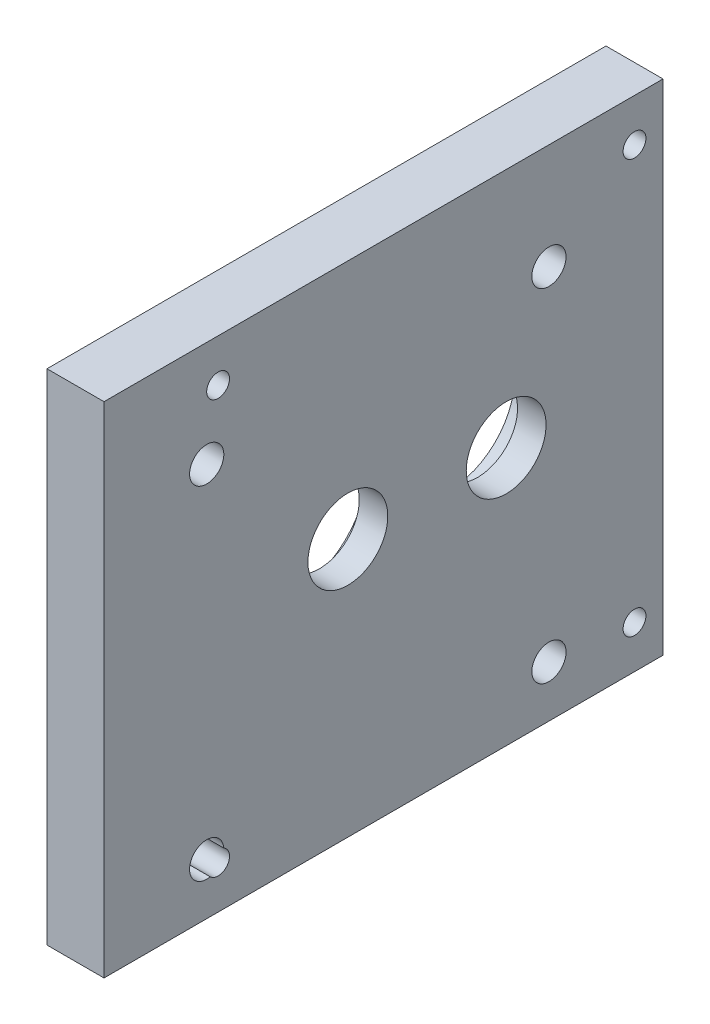
ISO-10303-21;
HEADER;
FILE_DESCRIPTION(('STEP AP214'),'2;1');
FILE_NAME('part.step','',(''),(''),'','','');
FILE_SCHEMA(('AUTOMOTIVE_DESIGN { 1 0 10303 214 1 1 1 1 }'));
ENDSEC;
DATA;
#1=APPLICATION_CONTEXT('core data for automotive mechanical design processes');
#2=APPLICATION_PROTOCOL_DEFINITION('international standard','automotive_design',2000,#1);
#3=PRODUCT_CONTEXT('',#1,'mechanical');
#4=PRODUCT('Part','Part','',(#3));
#5=PRODUCT_RELATED_PRODUCT_CATEGORY('part','',(#4));
#6=PRODUCT_DEFINITION_FORMATION('','',#4);
#7=PRODUCT_DEFINITION_CONTEXT('part definition',#1,'design');
#8=PRODUCT_DEFINITION('design','',#6,#7);
#9=PRODUCT_DEFINITION_SHAPE('','',#8);
#10=(LENGTH_UNIT() NAMED_UNIT(*) SI_UNIT(.MILLI.,.METRE.));
#11=(NAMED_UNIT(*) PLANE_ANGLE_UNIT() SI_UNIT($,.RADIAN.));
#12=(NAMED_UNIT(*) SI_UNIT($,.STERADIAN.) SOLID_ANGLE_UNIT());
#13=UNCERTAINTY_MEASURE_WITH_UNIT(LENGTH_MEASURE(1.E-05),#10,'distance_accuracy_value','');
#14=(GEOMETRIC_REPRESENTATION_CONTEXT(3) GLOBAL_UNCERTAINTY_ASSIGNED_CONTEXT((#13)) GLOBAL_UNIT_ASSIGNED_CONTEXT((#10,
#11,#12)) REPRESENTATION_CONTEXT('',''));
#15=CARTESIAN_POINT('',(0.,0.,0.));
#16=DIRECTION('',(0.,0.,1.));
#17=DIRECTION('',(1.,0.,0.));
#18=AXIS2_PLACEMENT_3D('',#15,#16,#17);
#19=CARTESIAN_POINT('',(-10.,175.,-98.));
#20=DIRECTION('',(1.,0.,0.));
#21=DIRECTION('',(0.,0.,-1.));
#22=AXIS2_PLACEMENT_3D('',#19,#20,#21);
#23=PLANE('',#22);
#24=CARTESIAN_POINT('',(-10.,138.,-58.));
#25=DIRECTION('',(-1.,0.,0.));
#26=DIRECTION('',(0.,0.,-1.));
#27=AXIS2_PLACEMENT_3D('',#24,#25,#26);
#28=CIRCLE('',#27,6.);
#29=CARTESIAN_POINT('',(-10.,138.,-64.));
#30=VERTEX_POINT('',#29);
#31=EDGE_CURVE('E216',#30,#30,#28,.T.);
#32=ORIENTED_EDGE('',*,*,#31,.F.);
#33=EDGE_LOOP('',(#32));
#34=FACE_BOUND('',#33,.T.);
#35=CARTESIAN_POINT('',(-10.,18.,-57.9999999999999));
#36=DIRECTION('',(-1.,0.,0.));
#37=DIRECTION('',(0.,0.,1.));
#38=AXIS2_PLACEMENT_3D('',#35,#36,#37);
#39=CIRCLE('',#38,6.);
#40=CARTESIAN_POINT('',(-10.,18.,-51.9999999999999));
#41=VERTEX_POINT('',#40);
#42=EDGE_CURVE('E220',#41,#41,#39,.T.);
#43=ORIENTED_EDGE('',*,*,#42,.F.);
#44=EDGE_LOOP('',(#43));
#45=FACE_BOUND('',#44,.T.);
#46=CARTESIAN_POINT('',(-10.,138.,62.));
#47=DIRECTION('',(-1.,0.,0.));
#48=DIRECTION('',(0.,0.,1.));
#49=AXIS2_PLACEMENT_3D('',#46,#47,#48);
#50=CIRCLE('',#49,6.);
#51=CARTESIAN_POINT('',(-10.,138.,68.));
#52=VERTEX_POINT('',#51);
#53=EDGE_CURVE('E224',#52,#52,#50,.T.);
#54=ORIENTED_EDGE('',*,*,#53,.F.);
#55=EDGE_LOOP('',(#54));
#56=FACE_BOUND('',#55,.T.);
#57=CARTESIAN_POINT('',(-10.,160.,58.0000000000001));
#58=DIRECTION('',(-1.,0.,0.));
#59=DIRECTION('',(0.,0.,1.));
#60=AXIS2_PLACEMENT_3D('',#57,#58,#59);
#61=CIRCLE('',#60,4.00000000000001);
#62=CARTESIAN_POINT('',(-10.,160.,62.0000000000001));
#63=VERTEX_POINT('',#62);
#64=EDGE_CURVE('E228',#63,#63,#61,.T.);
#65=ORIENTED_EDGE('',*,*,#64,.F.);
#66=EDGE_LOOP('',(#65));
#67=FACE_BOUND('',#66,.T.);
#68=CARTESIAN_POINT('',(-10.,160.,-88.));
#69=DIRECTION('',(-1.,0.,0.));
#70=DIRECTION('',(0.,0.,1.));
#71=AXIS2_PLACEMENT_3D('',#68,#69,#70);
#72=CIRCLE('',#71,4.00000000000001);
#73=CARTESIAN_POINT('',(-10.,160.,-83.9999999999999));
#74=VERTEX_POINT('',#73);
#75=EDGE_CURVE('E232',#74,#74,#72,.T.);
#76=ORIENTED_EDGE('',*,*,#75,.F.);
#77=EDGE_LOOP('',(#76));
#78=FACE_BOUND('',#77,.T.);
#79=CARTESIAN_POINT('',(-10.,15.,-88.));
#80=DIRECTION('',(-1.,0.,0.));
#81=DIRECTION('',(0.,0.,1.));
#82=AXIS2_PLACEMENT_3D('',#79,#80,#81);
#83=CIRCLE('',#82,4.00000000000001);
#84=CARTESIAN_POINT('',(-10.,15.,-83.9999999999999));
#85=VERTEX_POINT('',#84);
#86=EDGE_CURVE('E116',#85,#85,#83,.T.);
#87=ORIENTED_EDGE('',*,*,#86,.F.);
#88=EDGE_LOOP('',(#87));
#89=FACE_BOUND('',#88,.T.);
#90=CARTESIAN_POINT('',(-10.,15.,58.0000000000001));
#91=DIRECTION('',(-1.,0.,0.));
#92=DIRECTION('',(0.,0.,1.));
#93=AXIS2_PLACEMENT_3D('',#90,#91,#92);
#94=CIRCLE('',#93,4.00000000000001);
#95=CARTESIAN_POINT('',(-10.,18.4749015732775,56.0188238200419));
#96=VERTEX_POINT('',#95);
#97=CARTESIAN_POINT('',(-10.,12.1250984267225,60.7811761799582));
#98=VERTEX_POINT('',#97);
#99=EDGE_CURVE('E106',#96,#98,#94,.T.);
#100=ORIENTED_EDGE('',*,*,#99,.F.);
#101=CARTESIAN_POINT('',(-10.,18.,62.));
#102=DIRECTION('',(-1.,0.,0.));
#103=DIRECTION('',(0.,0.,-1.));
#104=AXIS2_PLACEMENT_3D('',#101,#102,#103);
#105=CIRCLE('',#104,6.);
#106=EDGE_CURVE('E97',#98,#96,#105,.T.);
#107=ORIENTED_EDGE('',*,*,#106,.F.);
#108=EDGE_LOOP('',(#100,#107));
#109=FACE_BOUND('',#108,.T.);
#110=CARTESIAN_POINT('',(-10.,90.5,12.5));
#111=DIRECTION('',(-1.,0.,0.));
#112=DIRECTION('',(0.,0.,1.));
#113=AXIS2_PLACEMENT_3D('',#110,#111,#112);
#114=CIRCLE('',#113,27.5);
#115=CARTESIAN_POINT('',(-10.,90.5,40.));
#116=VERTEX_POINT('',#115);
#117=EDGE_CURVE('E141',#116,#116,#114,.T.);
#118=ORIENTED_EDGE('',*,*,#117,.F.);
#119=EDGE_LOOP('',(#118));
#120=FACE_BOUND('',#119,.T.);
#121=CARTESIAN_POINT('',(-10.,90.5,-43.));
#122=DIRECTION('',(-1.,0.,0.));
#123=DIRECTION('',(0.,0.,1.));
#124=AXIS2_PLACEMENT_3D('',#121,#122,#123);
#125=CIRCLE('',#124,23.);
#126=CARTESIAN_POINT('',(-10.,90.5,-20.));
#127=VERTEX_POINT('',#126);
#128=EDGE_CURVE('E124',#127,#127,#125,.T.);
#129=ORIENTED_EDGE('',*,*,#128,.F.);
#130=EDGE_LOOP('',(#129));
#131=FACE_BOUND('',#130,.T.);
#132=DIRECTION('',(0.,0.,1.));
#133=VECTOR('',#132,1.);
#134=CARTESIAN_POINT('',(-10.,0.,-98.));
#135=LINE('',#134,#133);
#136=CARTESIAN_POINT('',(-10.,0.,-98.));
#137=VERTEX_POINT('',#136);
#138=CARTESIAN_POINT('',(-10.,0.,98.));
#139=VERTEX_POINT('',#138);
#140=EDGE_CURVE('E140',#137,#139,#135,.T.);
#141=ORIENTED_EDGE('',*,*,#140,.T.);
#142=DIRECTION('',(0.,-1.,0.));
#143=VECTOR('',#142,1.);
#144=CARTESIAN_POINT('',(-10.,175.,98.));
#145=LINE('',#144,#143);
#146=CARTESIAN_POINT('',(-10.,175.,98.));
#147=VERTEX_POINT('',#146);
#148=EDGE_CURVE('E102',#147,#139,#145,.T.);
#149=ORIENTED_EDGE('',*,*,#148,.F.);
#150=DIRECTION('',(0.,0.,1.));
#151=VECTOR('',#150,1.);
#152=CARTESIAN_POINT('',(-10.,175.,-98.));
#153=LINE('',#152,#151);
#154=CARTESIAN_POINT('',(-10.,175.,-98.));
#155=VERTEX_POINT('',#154);
#156=EDGE_CURVE('E152',#155,#147,#153,.T.);
#157=ORIENTED_EDGE('',*,*,#156,.F.);
#158=DIRECTION('',(0.,-1.,0.));
#159=VECTOR('',#158,1.);
#160=CARTESIAN_POINT('',(-10.,175.,-98.));
#161=LINE('',#160,#159);
#162=EDGE_CURVE('E162',#155,#137,#161,.T.);
#163=ORIENTED_EDGE('',*,*,#162,.T.);
#164=EDGE_LOOP('',(#141,#149,#157,#163));
#165=FACE_BOUND('',#164,.T.);
#166=ADVANCED_FACE('F36',(#34,#45,#56,#67,#78,#89,#109,#120,#131,#165),#23,.F.);
#167=CARTESIAN_POINT('',(-10.,175.,98.));
#168=DIRECTION('',(0.,0.,-1.));
#169=DIRECTION('',(-1.,0.,0.));
#170=AXIS2_PLACEMENT_3D('',#167,#168,#169);
#171=PLANE('',#170);
#172=DIRECTION('',(1.,0.,0.));
#173=VECTOR('',#172,1.);
#174=CARTESIAN_POINT('',(-10.,0.,98.));
#175=LINE('',#174,#173);
#176=CARTESIAN_POINT('',(10.,0.,98.));
#177=VERTEX_POINT('',#176);
#178=EDGE_CURVE('E166',#139,#177,#175,.T.);
#179=ORIENTED_EDGE('',*,*,#178,.T.);
#180=DIRECTION('',(0.,-1.,0.));
#181=VECTOR('',#180,1.);
#182=CARTESIAN_POINT('',(10.,175.,98.));
#183=LINE('',#182,#181);
#184=CARTESIAN_POINT('',(10.,175.,98.));
#185=VERTEX_POINT('',#184);
#186=EDGE_CURVE('E179',#185,#177,#183,.T.);
#187=ORIENTED_EDGE('',*,*,#186,.F.);
#188=DIRECTION('',(1.,0.,0.));
#189=VECTOR('',#188,1.);
#190=CARTESIAN_POINT('',(-10.,175.,98.));
#191=LINE('',#190,#189);
#192=EDGE_CURVE('E88',#147,#185,#191,.T.);
#193=ORIENTED_EDGE('',*,*,#192,.F.);
#194=ORIENTED_EDGE('',*,*,#148,.T.);
#195=EDGE_LOOP('',(#179,#187,#193,#194));
#196=FACE_BOUND('',#195,.T.);
#197=ADVANCED_FACE('F185',(#196),#171,.F.);
#198=CARTESIAN_POINT('',(9.99999999999998,175.,-98.));
#199=DIRECTION('',(-1.,0.,0.));
#200=DIRECTION('',(0.,0.,1.));
#201=AXIS2_PLACEMENT_3D('',#198,#199,#200);
#202=PLANE('',#201);
#203=CARTESIAN_POINT('',(10.0000000000001,138.,-58.));
#204=DIRECTION('',(-1.,0.,0.));
#205=DIRECTION('',(0.,0.,-1.));
#206=AXIS2_PLACEMENT_3D('',#203,#204,#205);
#207=CIRCLE('',#206,6.);
#208=CARTESIAN_POINT('',(10.0000000000001,138.,-64.));
#209=VERTEX_POINT('',#208);
#210=EDGE_CURVE('E107',#209,#209,#207,.T.);
#211=ORIENTED_EDGE('',*,*,#210,.T.);
#212=EDGE_LOOP('',(#211));
#213=FACE_BOUND('',#212,.T.);
#214=CARTESIAN_POINT('',(10.0000000000001,18.,-57.9999999999999));
#215=DIRECTION('',(-1.,0.,0.));
#216=DIRECTION('',(0.,0.,1.));
#217=AXIS2_PLACEMENT_3D('',#214,#215,#216);
#218=CIRCLE('',#217,6.);
#219=CARTESIAN_POINT('',(10.0000000000001,18.,-51.9999999999999));
#220=VERTEX_POINT('',#219);
#221=EDGE_CURVE('E253',#220,#220,#218,.T.);
#222=ORIENTED_EDGE('',*,*,#221,.T.);
#223=EDGE_LOOP('',(#222));
#224=FACE_BOUND('',#223,.T.);
#225=CARTESIAN_POINT('',(10.0000000000001,138.,62.));
#226=DIRECTION('',(-1.,0.,0.));
#227=DIRECTION('',(0.,0.,1.));
#228=AXIS2_PLACEMENT_3D('',#225,#226,#227);
#229=CIRCLE('',#228,6.);
#230=CARTESIAN_POINT('',(10.0000000000001,138.,68.));
#231=VERTEX_POINT('',#230);
#232=EDGE_CURVE('E245',#231,#231,#229,.T.);
#233=ORIENTED_EDGE('',*,*,#232,.T.);
#234=EDGE_LOOP('',(#233));
#235=FACE_BOUND('',#234,.T.);
#236=CARTESIAN_POINT('',(10.0000000000001,160.,58.));
#237=DIRECTION('',(-1.,0.,0.));
#238=DIRECTION('',(0.,0.,1.));
#239=AXIS2_PLACEMENT_3D('',#236,#237,#238);
#240=CIRCLE('',#239,4.00000000000001);
#241=CARTESIAN_POINT('',(10.0000000000001,160.,62.0000000000001));
#242=VERTEX_POINT('',#241);
#243=EDGE_CURVE('E243',#242,#242,#240,.T.);
#244=ORIENTED_EDGE('',*,*,#243,.T.);
#245=EDGE_LOOP('',(#244));
#246=FACE_BOUND('',#245,.T.);
#247=CARTESIAN_POINT('',(10.0000000000001,160.,-88.));
#248=DIRECTION('',(-1.,0.,0.));
#249=DIRECTION('',(0.,0.,1.));
#250=AXIS2_PLACEMENT_3D('',#247,#248,#249);
#251=CIRCLE('',#250,4.00000000000001);
#252=CARTESIAN_POINT('',(10.0000000000001,160.,-83.9999999999999));
#253=VERTEX_POINT('',#252);
#254=EDGE_CURVE('E236',#253,#253,#251,.T.);
#255=ORIENTED_EDGE('',*,*,#254,.T.);
#256=EDGE_LOOP('',(#255));
#257=FACE_BOUND('',#256,.T.);
#258=CARTESIAN_POINT('',(10.0000000000001,15.,-88.));
#259=DIRECTION('',(-1.,0.,0.));
#260=DIRECTION('',(0.,0.,1.));
#261=AXIS2_PLACEMENT_3D('',#258,#259,#260);
#262=CIRCLE('',#261,4.00000000000001);
#263=CARTESIAN_POINT('',(10.0000000000001,15.,-83.9999999999999));
#264=VERTEX_POINT('',#263);
#265=EDGE_CURVE('E111',#264,#264,#262,.T.);
#266=ORIENTED_EDGE('',*,*,#265,.T.);
#267=EDGE_LOOP('',(#266));
#268=FACE_BOUND('',#267,.T.);
#269=CARTESIAN_POINT('',(10.0000000000001,15.,58.));
#270=DIRECTION('',(-1.,0.,0.));
#271=DIRECTION('',(0.,0.,1.));
#272=AXIS2_PLACEMENT_3D('',#269,#270,#271);
#273=CIRCLE('',#272,4.00000000000001);
#274=CARTESIAN_POINT('',(10.0000000000001,18.4749015732775,56.0188238200419));
#275=VERTEX_POINT('',#274);
#276=CARTESIAN_POINT('',(10.0000000000001,12.1250984267225,60.7811761799582));
#277=VERTEX_POINT('',#276);
#278=EDGE_CURVE('E110',#275,#277,#273,.T.);
#279=ORIENTED_EDGE('',*,*,#278,.T.);
#280=CARTESIAN_POINT('',(10.0000000000001,18.,62.));
#281=DIRECTION('',(-1.,0.,0.));
#282=DIRECTION('',(0.,0.,-1.));
#283=AXIS2_PLACEMENT_3D('',#280,#281,#282);
#284=CIRCLE('',#283,6.);
#285=EDGE_CURVE('E50',#277,#275,#284,.T.);
#286=ORIENTED_EDGE('',*,*,#285,.T.);
#287=EDGE_LOOP('',(#279,#286));
#288=FACE_BOUND('',#287,.T.);
#289=CARTESIAN_POINT('',(10.,90.5,12.5));
#290=DIRECTION('',(-1.,0.,0.));
#291=DIRECTION('',(0.,0.,1.));
#292=AXIS2_PLACEMENT_3D('',#289,#290,#291);
#293=CIRCLE('',#292,14.);
#294=CARTESIAN_POINT('',(10.0000000000001,90.5,26.5));
#295=VERTEX_POINT('',#294);
#296=EDGE_CURVE('E120',#295,#295,#293,.T.);
#297=ORIENTED_EDGE('',*,*,#296,.T.);
#298=EDGE_LOOP('',(#297));
#299=FACE_BOUND('',#298,.T.);
#300=CARTESIAN_POINT('',(10.,90.5,-43.));
#301=DIRECTION('',(-1.,0.,0.));
#302=DIRECTION('',(0.,0.,1.));
#303=AXIS2_PLACEMENT_3D('',#300,#301,#302);
#304=CIRCLE('',#303,14.);
#305=CARTESIAN_POINT('',(10.,90.5,-29.));
#306=VERTEX_POINT('',#305);
#307=EDGE_CURVE('E129',#306,#306,#304,.T.);
#308=ORIENTED_EDGE('',*,*,#307,.T.);
#309=EDGE_LOOP('',(#308));
#310=FACE_BOUND('',#309,.T.);
#311=DIRECTION('',(0.,0.,-1.));
#312=VECTOR('',#311,1.);
#313=CARTESIAN_POINT('',(9.99999999999998,0.,-98.));
#314=LINE('',#313,#312);
#315=CARTESIAN_POINT('',(9.99999999999998,0.,-98.));
#316=VERTEX_POINT('',#315);
#317=EDGE_CURVE('E169',#177,#316,#314,.T.);
#318=ORIENTED_EDGE('',*,*,#317,.T.);
#319=DIRECTION('',(0.,-1.,0.));
#320=VECTOR('',#319,1.);
#321=CARTESIAN_POINT('',(9.99999999999998,175.,-98.));
#322=LINE('',#321,#320);
#323=CARTESIAN_POINT('',(9.99999999999998,175.,-98.));
#324=VERTEX_POINT('',#323);
#325=EDGE_CURVE('E176',#324,#316,#322,.T.);
#326=ORIENTED_EDGE('',*,*,#325,.F.);
#327=DIRECTION('',(0.,0.,-1.));
#328=VECTOR('',#327,1.);
#329=CARTESIAN_POINT('',(9.99999999999998,175.,-98.));
#330=LINE('',#329,#328);
#331=EDGE_CURVE('E157',#185,#324,#330,.T.);
#332=ORIENTED_EDGE('',*,*,#331,.F.);
#333=ORIENTED_EDGE('',*,*,#186,.T.);
#334=EDGE_LOOP('',(#318,#326,#332,#333));
#335=FACE_BOUND('',#334,.T.);
#336=ADVANCED_FACE('F194',(#213,#224,#235,#246,#257,#268,#288,#299,#310,#335),#202,.F.);
#337=CARTESIAN_POINT('',(-10.,175.,-98.));
#338=DIRECTION('',(0.,0.,1.));
#339=DIRECTION('',(1.,0.,0.));
#340=AXIS2_PLACEMENT_3D('',#337,#338,#339);
#341=PLANE('',#340);
#342=DIRECTION('',(-1.,0.,0.));
#343=VECTOR('',#342,1.);
#344=CARTESIAN_POINT('',(-10.,0.,-98.));
#345=LINE('',#344,#343);
#346=EDGE_CURVE('E80',#316,#137,#345,.T.);
#347=ORIENTED_EDGE('',*,*,#346,.T.);
#348=ORIENTED_EDGE('',*,*,#162,.F.);
#349=DIRECTION('',(-1.,0.,0.));
#350=VECTOR('',#349,1.);
#351=CARTESIAN_POINT('',(-10.,175.,-98.));
#352=LINE('',#351,#350);
#353=EDGE_CURVE('E59',#324,#155,#352,.T.);
#354=ORIENTED_EDGE('',*,*,#353,.F.);
#355=ORIENTED_EDGE('',*,*,#325,.T.);
#356=EDGE_LOOP('',(#347,#348,#354,#355));
#357=FACE_BOUND('',#356,.T.);
#358=ADVANCED_FACE('F196',(#357),#341,.F.);
#359=CARTESIAN_POINT('',(0.,175.,0.));
#360=DIRECTION('',(0.,1.,0.));
#361=DIRECTION('',(0.,0.,1.));
#362=AXIS2_PLACEMENT_3D('',#359,#360,#361);
#363=PLANE('',#362);
#364=ORIENTED_EDGE('',*,*,#156,.T.);
#365=ORIENTED_EDGE('',*,*,#192,.T.);
#366=ORIENTED_EDGE('',*,*,#331,.T.);
#367=ORIENTED_EDGE('',*,*,#353,.T.);
#368=EDGE_LOOP('',(#364,#365,#366,#367));
#369=FACE_BOUND('',#368,.T.);
#370=ADVANCED_FACE('F197',(#369),#363,.T.);
#371=CARTESIAN_POINT('',(0.,0.,0.));
#372=DIRECTION('',(0.,1.,0.));
#373=DIRECTION('',(0.,0.,1.));
#374=AXIS2_PLACEMENT_3D('',#371,#372,#373);
#375=PLANE('',#374);
#376=ORIENTED_EDGE('',*,*,#140,.F.);
#377=ORIENTED_EDGE('',*,*,#346,.F.);
#378=ORIENTED_EDGE('',*,*,#317,.F.);
#379=ORIENTED_EDGE('',*,*,#178,.F.);
#380=EDGE_LOOP('',(#376,#377,#378,#379));
#381=FACE_BOUND('',#380,.T.);
#382=ADVANCED_FACE('F190',(#381),#375,.F.);
#383=CARTESIAN_POINT('',(0.,90.5,-43.));
#384=DIRECTION('',(-1.,0.,0.));
#385=DIRECTION('',(0.,0.,1.));
#386=AXIS2_PLACEMENT_3D('',#383,#384,#385);
#387=CYLINDRICAL_SURFACE('',#386,23.);
#388=CARTESIAN_POINT('',(0.,90.5,-43.));
#389=DIRECTION('',(-1.,0.,0.));
#390=DIRECTION('',(0.,0.,1.));
#391=AXIS2_PLACEMENT_3D('',#388,#389,#390);
#392=CIRCLE('',#391,23.);
#393=CARTESIAN_POINT('',(0.,90.5,-20.));
#394=VERTEX_POINT('',#393);
#395=EDGE_CURVE('E145',#394,#394,#392,.T.);
#396=ORIENTED_EDGE('',*,*,#395,.F.);
#397=EDGE_LOOP('',(#396));
#398=FACE_BOUND('',#397,.T.);
#399=ORIENTED_EDGE('',*,*,#128,.T.);
#400=EDGE_LOOP('',(#399));
#401=FACE_BOUND('',#400,.T.);
#402=ADVANCED_FACE('F204',(#398,#401),#387,.F.);
#403=CARTESIAN_POINT('',(0.,90.5,-43.));
#404=DIRECTION('',(-1.,0.,0.));
#405=DIRECTION('',(0.,0.,1.));
#406=AXIS2_PLACEMENT_3D('',#403,#404,#405);
#407=PLANE('',#406);
#408=CARTESIAN_POINT('',(0.,90.5,-43.));
#409=DIRECTION('',(-1.,0.,0.));
#410=DIRECTION('',(0.,0.,1.));
#411=AXIS2_PLACEMENT_3D('',#408,#409,#410);
#412=CIRCLE('',#411,14.);
#413=CARTESIAN_POINT('',(0.,90.5,-29.));
#414=VERTEX_POINT('',#413);
#415=EDGE_CURVE('E113',#414,#414,#412,.T.);
#416=ORIENTED_EDGE('',*,*,#415,.F.);
#417=EDGE_LOOP('',(#416));
#418=FACE_BOUND('',#417,.T.);
#419=ORIENTED_EDGE('',*,*,#395,.T.);
#420=EDGE_LOOP('',(#419));
#421=FACE_BOUND('',#420,.T.);
#422=ADVANCED_FACE('F308',(#418,#421),#407,.T.);
#423=CARTESIAN_POINT('',(0.,90.5,12.5));
#424=DIRECTION('',(-1.,0.,0.));
#425=DIRECTION('',(0.,0.,1.));
#426=AXIS2_PLACEMENT_3D('',#423,#424,#425);
#427=CYLINDRICAL_SURFACE('',#426,27.5);
#428=CARTESIAN_POINT('',(0.,90.5,12.5));
#429=DIRECTION('',(-1.,0.,0.));
#430=DIRECTION('',(0.,0.,1.));
#431=AXIS2_PLACEMENT_3D('',#428,#429,#430);
#432=CIRCLE('',#431,27.5);
#433=CARTESIAN_POINT('',(0.,90.5,40.));
#434=VERTEX_POINT('',#433);
#435=EDGE_CURVE('E136',#434,#434,#432,.T.);
#436=ORIENTED_EDGE('',*,*,#435,.F.);
#437=EDGE_LOOP('',(#436));
#438=FACE_BOUND('',#437,.T.);
#439=ORIENTED_EDGE('',*,*,#117,.T.);
#440=EDGE_LOOP('',(#439));
#441=FACE_BOUND('',#440,.T.);
#442=ADVANCED_FACE('F304',(#438,#441),#427,.F.);
#443=CARTESIAN_POINT('',(0.,90.5,12.5));
#444=DIRECTION('',(-1.,0.,0.));
#445=DIRECTION('',(0.,0.,1.));
#446=AXIS2_PLACEMENT_3D('',#443,#444,#445);
#447=PLANE('',#446);
#448=CARTESIAN_POINT('',(0.,90.5,12.5));
#449=DIRECTION('',(-1.,0.,0.));
#450=DIRECTION('',(0.,0.,1.));
#451=AXIS2_PLACEMENT_3D('',#448,#449,#450);
#452=CIRCLE('',#451,14.);
#453=CARTESIAN_POINT('',(0.,90.5,26.5));
#454=VERTEX_POINT('',#453);
#455=EDGE_CURVE('E125',#454,#454,#452,.T.);
#456=ORIENTED_EDGE('',*,*,#455,.F.);
#457=EDGE_LOOP('',(#456));
#458=FACE_BOUND('',#457,.T.);
#459=ORIENTED_EDGE('',*,*,#435,.T.);
#460=EDGE_LOOP('',(#459));
#461=FACE_BOUND('',#460,.T.);
#462=ADVANCED_FACE('F300',(#458,#461),#447,.T.);
#463=CARTESIAN_POINT('',(10.,90.5,-43.));
#464=DIRECTION('',(-1.,0.,0.));
#465=DIRECTION('',(0.,0.,1.));
#466=AXIS2_PLACEMENT_3D('',#463,#464,#465);
#467=CYLINDRICAL_SURFACE('',#466,14.);
#468=ORIENTED_EDGE('',*,*,#307,.F.);
#469=EDGE_LOOP('',(#468));
#470=FACE_BOUND('',#469,.T.);
#471=ORIENTED_EDGE('',*,*,#415,.T.);
#472=EDGE_LOOP('',(#471));
#473=FACE_BOUND('',#472,.T.);
#474=ADVANCED_FACE('F296',(#470,#473),#467,.F.);
#475=CARTESIAN_POINT('',(10.,90.5,12.5));
#476=DIRECTION('',(-1.,0.,0.));
#477=DIRECTION('',(0.,0.,1.));
#478=AXIS2_PLACEMENT_3D('',#475,#476,#477);
#479=CYLINDRICAL_SURFACE('',#478,14.);
#480=ORIENTED_EDGE('',*,*,#296,.F.);
#481=EDGE_LOOP('',(#480));
#482=FACE_BOUND('',#481,.T.);
#483=ORIENTED_EDGE('',*,*,#455,.T.);
#484=EDGE_LOOP('',(#483));
#485=FACE_BOUND('',#484,.T.);
#486=ADVANCED_FACE('F293',(#482,#485),#479,.F.);
#487=CARTESIAN_POINT('',(10.0000000000001,15.,58.));
#488=DIRECTION('',(-1.,0.,0.));
#489=DIRECTION('',(0.,0.,1.));
#490=AXIS2_PLACEMENT_3D('',#487,#488,#489);
#491=CYLINDRICAL_SURFACE('',#490,4.00000000000001);
#492=ORIENTED_EDGE('',*,*,#278,.F.);
#493=DIRECTION('',(-1.,0.,0.));
#494=VECTOR('',#493,1.);
#495=CARTESIAN_POINT('',(0.,18.4749015732775,56.0188238200419));
#496=LINE('',#495,#494);
#497=EDGE_CURVE('E11',#275,#96,#496,.T.);
#498=ORIENTED_EDGE('',*,*,#497,.T.);
#499=ORIENTED_EDGE('',*,*,#99,.T.);
#500=DIRECTION('',(-1.,0.,0.));
#501=VECTOR('',#500,1.);
#502=CARTESIAN_POINT('',(0.,12.1250984267225,60.7811761799582));
#503=LINE('',#502,#501);
#504=EDGE_CURVE('E43',#98,#277,#503,.F.);
#505=ORIENTED_EDGE('',*,*,#504,.T.);
#506=EDGE_LOOP('',(#492,#498,#499,#505));
#507=FACE_BOUND('',#506,.T.);
#508=ADVANCED_FACE('F109',(#507),#491,.F.);
#509=CARTESIAN_POINT('',(10.0000000000001,15.,-88.));
#510=DIRECTION('',(-1.,0.,0.));
#511=DIRECTION('',(0.,0.,1.));
#512=AXIS2_PLACEMENT_3D('',#509,#510,#511);
#513=CYLINDRICAL_SURFACE('',#512,4.00000000000001);
#514=ORIENTED_EDGE('',*,*,#265,.F.);
#515=EDGE_LOOP('',(#514));
#516=FACE_BOUND('',#515,.T.);
#517=ORIENTED_EDGE('',*,*,#86,.T.);
#518=EDGE_LOOP('',(#517));
#519=FACE_BOUND('',#518,.T.);
#520=ADVANCED_FACE('F280',(#516,#519),#513,.F.);
#521=CARTESIAN_POINT('',(10.0000000000001,160.,-88.));
#522=DIRECTION('',(-1.,0.,0.));
#523=DIRECTION('',(0.,0.,1.));
#524=AXIS2_PLACEMENT_3D('',#521,#522,#523);
#525=CYLINDRICAL_SURFACE('',#524,4.00000000000001);
#526=ORIENTED_EDGE('',*,*,#254,.F.);
#527=EDGE_LOOP('',(#526));
#528=FACE_BOUND('',#527,.T.);
#529=ORIENTED_EDGE('',*,*,#75,.T.);
#530=EDGE_LOOP('',(#529));
#531=FACE_BOUND('',#530,.T.);
#532=ADVANCED_FACE('F283',(#528,#531),#525,.F.);
#533=CARTESIAN_POINT('',(10.0000000000001,160.,58.));
#534=DIRECTION('',(-1.,0.,0.));
#535=DIRECTION('',(0.,0.,1.));
#536=AXIS2_PLACEMENT_3D('',#533,#534,#535);
#537=CYLINDRICAL_SURFACE('',#536,4.00000000000001);
#538=ORIENTED_EDGE('',*,*,#243,.F.);
#539=EDGE_LOOP('',(#538));
#540=FACE_BOUND('',#539,.T.);
#541=ORIENTED_EDGE('',*,*,#64,.T.);
#542=EDGE_LOOP('',(#541));
#543=FACE_BOUND('',#542,.T.);
#544=ADVANCED_FACE('F278',(#540,#543),#537,.F.);
#545=CARTESIAN_POINT('',(10.0000000000001,18.,62.));
#546=DIRECTION('',(-1.,0.,0.));
#547=DIRECTION('',(0.,0.,1.));
#548=AXIS2_PLACEMENT_3D('',#545,#546,#547);
#549=CYLINDRICAL_SURFACE('',#548,6.);
#550=ORIENTED_EDGE('',*,*,#285,.F.);
#551=ORIENTED_EDGE('',*,*,#504,.F.);
#552=ORIENTED_EDGE('',*,*,#106,.T.);
#553=ORIENTED_EDGE('',*,*,#497,.F.);
#554=EDGE_LOOP('',(#550,#551,#552,#553));
#555=FACE_BOUND('',#554,.T.);
#556=ADVANCED_FACE('F96',(#555),#549,.F.);
#557=CARTESIAN_POINT('',(10.0000000000001,138.,62.));
#558=DIRECTION('',(-1.,0.,0.));
#559=DIRECTION('',(0.,0.,1.));
#560=AXIS2_PLACEMENT_3D('',#557,#558,#559);
#561=CYLINDRICAL_SURFACE('',#560,6.);
#562=ORIENTED_EDGE('',*,*,#232,.F.);
#563=EDGE_LOOP('',(#562));
#564=FACE_BOUND('',#563,.T.);
#565=ORIENTED_EDGE('',*,*,#53,.T.);
#566=EDGE_LOOP('',(#565));
#567=FACE_BOUND('',#566,.T.);
#568=ADVANCED_FACE('F266',(#564,#567),#561,.F.);
#569=CARTESIAN_POINT('',(10.0000000000001,18.,-57.9999999999999));
#570=DIRECTION('',(-1.,0.,0.));
#571=DIRECTION('',(0.,0.,1.));
#572=AXIS2_PLACEMENT_3D('',#569,#570,#571);
#573=CYLINDRICAL_SURFACE('',#572,6.);
#574=ORIENTED_EDGE('',*,*,#221,.F.);
#575=EDGE_LOOP('',(#574));
#576=FACE_BOUND('',#575,.T.);
#577=ORIENTED_EDGE('',*,*,#42,.T.);
#578=EDGE_LOOP('',(#577));
#579=FACE_BOUND('',#578,.T.);
#580=ADVANCED_FACE('F262',(#576,#579),#573,.F.);
#581=CARTESIAN_POINT('',(10.0000000000001,138.,-58.));
#582=DIRECTION('',(-1.,0.,0.));
#583=DIRECTION('',(0.,0.,1.));
#584=AXIS2_PLACEMENT_3D('',#581,#582,#583);
#585=CYLINDRICAL_SURFACE('',#584,6.);
#586=ORIENTED_EDGE('',*,*,#210,.F.);
#587=EDGE_LOOP('',(#586));
#588=FACE_BOUND('',#587,.T.);
#589=ORIENTED_EDGE('',*,*,#31,.T.);
#590=EDGE_LOOP('',(#589));
#591=FACE_BOUND('',#590,.T.);
#592=ADVANCED_FACE('F265',(#588,#591),#585,.F.);
#593=CLOSED_SHELL('',(#166,#197,#336,#358,#370,#382,#402,#422,#442,#462,#474,#486,#508,#520,
#532,#544,#556,#568,#580,#592));
#594=MANIFOLD_SOLID_BREP('B2',#593);
#595=ADVANCED_BREP_SHAPE_REPRESENTATION('',(#18,#594),#14);
#596=SHAPE_DEFINITION_REPRESENTATION(#9,#595);
ENDSEC;
END-ISO-10303-21;
